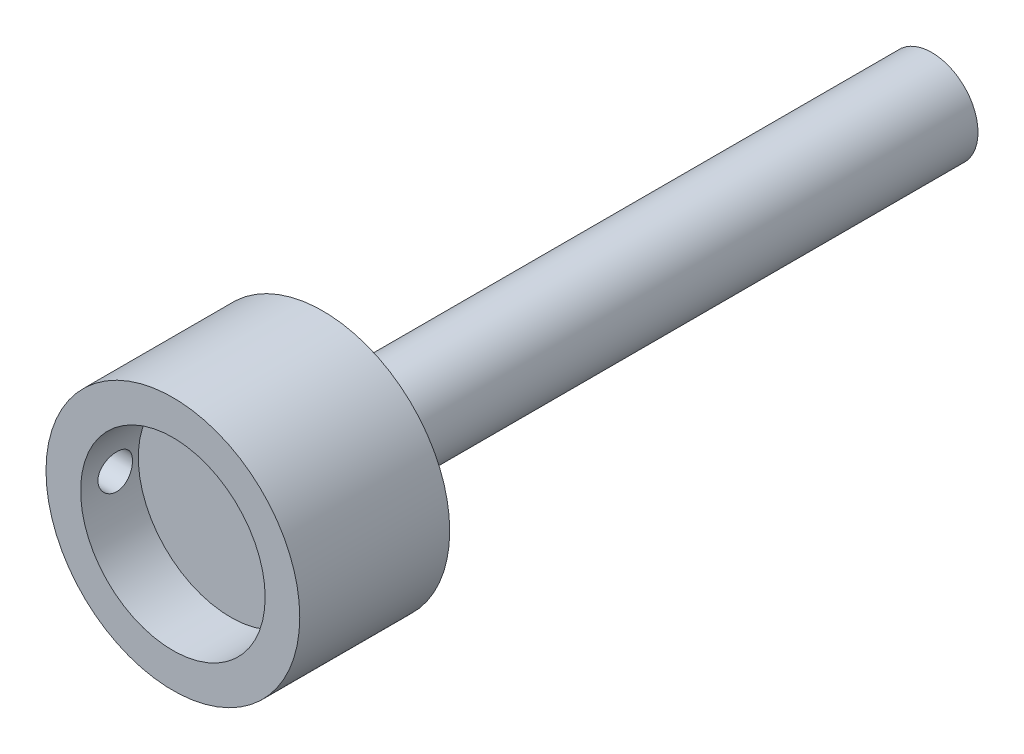
ISO-10303-21;
HEADER;
FILE_DESCRIPTION(('STEP AP214'),'2;1');
FILE_NAME('part.step','',(''),(''),'','','');
FILE_SCHEMA(('AUTOMOTIVE_DESIGN { 1 0 10303 214 1 1 1 1 }'));
ENDSEC;
DATA;
#1=APPLICATION_CONTEXT('core data for automotive mechanical design processes');
#2=APPLICATION_PROTOCOL_DEFINITION('international standard','automotive_design',2000,#1);
#3=PRODUCT_CONTEXT('',#1,'mechanical');
#4=PRODUCT('Part','Part','',(#3));
#5=PRODUCT_RELATED_PRODUCT_CATEGORY('part','',(#4));
#6=PRODUCT_DEFINITION_FORMATION('','',#4);
#7=PRODUCT_DEFINITION_CONTEXT('part definition',#1,'design');
#8=PRODUCT_DEFINITION('design','',#6,#7);
#9=PRODUCT_DEFINITION_SHAPE('','',#8);
#10=(LENGTH_UNIT() NAMED_UNIT(*) SI_UNIT(.MILLI.,.METRE.));
#11=(NAMED_UNIT(*) PLANE_ANGLE_UNIT() SI_UNIT($,.RADIAN.));
#12=(NAMED_UNIT(*) SI_UNIT($,.STERADIAN.) SOLID_ANGLE_UNIT());
#13=UNCERTAINTY_MEASURE_WITH_UNIT(LENGTH_MEASURE(1.E-05),#10,'distance_accuracy_value','');
#14=(GEOMETRIC_REPRESENTATION_CONTEXT(3) GLOBAL_UNCERTAINTY_ASSIGNED_CONTEXT((#13)) GLOBAL_UNIT_ASSIGNED_CONTEXT((#10,
#11,#12)) REPRESENTATION_CONTEXT('',''));
#15=CARTESIAN_POINT('',(0.,0.,0.));
#16=DIRECTION('',(0.,0.,1.));
#17=DIRECTION('',(1.,0.,0.));
#18=AXIS2_PLACEMENT_3D('',#15,#16,#17);
#19=CARTESIAN_POINT('',(0.,0.,13.));
#20=DIRECTION('',(0.,0.,-1.));
#21=DIRECTION('',(-1.,0.,0.));
#22=AXIS2_PLACEMENT_3D('',#19,#20,#21);
#23=CYLINDRICAL_SURFACE('',#22,11.);
#24=CARTESIAN_POINT('',(-11.,0.,11.5));
#25=CARTESIAN_POINT('',(-10.9999987467262,-0.0838384134298608,11.4999964805426));
#26=CARTESIAN_POINT('',(-10.9990314271488,-0.167727602289746,11.4929474073274));
#27=CARTESIAN_POINT('',(-10.9952656640845,-0.333167097641412,11.4649411167757));
#28=CARTESIAN_POINT('',(-10.992465364401,-0.414714945659857,11.4439698005502));
#29=CARTESIAN_POINT('',(-10.9853487739829,-0.573053093693594,11.3887522661594));
#30=CARTESIAN_POINT('',(-10.9810335583919,-0.649846722453227,11.3545154607979));
#31=CARTESIAN_POINT('',(-10.971365727223,-0.79658530244973,11.2737604754398));
#32=CARTESIAN_POINT('',(-10.9660132749006,-0.86653132885872,11.2272442277457));
#33=CARTESIAN_POINT('',(-10.9548285996925,-0.998057563812247,11.1229277857077));
#34=CARTESIAN_POINT('',(-10.9489937690522,-1.05958678462377,11.0650635769965));
#35=CARTESIAN_POINT('',(-10.9375227155932,-1.17209333908044,10.9398313892076));
#36=CARTESIAN_POINT('',(-10.9318865034525,-1.22307010612799,10.8724629001387));
#37=CARTESIAN_POINT('',(-10.9214253777188,-1.31321850524923,10.7297980617759));
#38=CARTESIAN_POINT('',(-10.916603830108,-1.35234166468404,10.6544708149948));
#39=CARTESIAN_POINT('',(-10.9083529406776,-1.41736264485278,10.4982381846263));
#40=CARTESIAN_POINT('',(-10.904923536173,-1.44326106107985,10.4173330523902));
#41=CARTESIAN_POINT('',(-10.8998704969217,-1.4809409055509,10.2527737564264));
#42=CARTESIAN_POINT('',(-10.8982357822449,-1.49280898864549,10.1691397807089));
#43=CARTESIAN_POINT('',(-10.8969234380482,-1.50235955059667,10.0010525269759));
#44=CARTESIAN_POINT('',(-10.8972457153308,-1.50004270497976,9.91659928816724));
#45=CARTESIAN_POINT('',(-10.8998008033656,-1.4813601701924,9.7498782743991));
#46=CARTESIAN_POINT('',(-10.9020205710196,-1.4650903891759,9.66759952363283));
#47=CARTESIAN_POINT('',(-10.9081001740818,-1.419113676953,9.50695095946735));
#48=CARTESIAN_POINT('',(-10.911960048455,-1.38940642650253,9.42858123898703));
#49=CARTESIAN_POINT('',(-10.920899582937,-1.31729641760208,9.27768007396237));
#50=CARTESIAN_POINT('',(-10.9259831927575,-1.27485243857761,9.20516857073198));
#51=CARTESIAN_POINT('',(-10.9367944433469,-1.1785032304482,9.06826085111422));
#52=CARTESIAN_POINT('',(-10.9425221191218,-1.12459737823042,9.00386507623326));
#53=CARTESIAN_POINT('',(-10.954033973898,-1.006325277838,8.88446044550542));
#54=CARTESIAN_POINT('',(-10.9598182294108,-0.941876450734229,8.82953335968757));
#55=CARTESIAN_POINT('',(-10.9707474705779,-0.80463094440541,8.73126350840162));
#56=CARTESIAN_POINT('',(-10.9758924542398,-0.73183423916464,8.68792077903695));
#57=CARTESIAN_POINT('',(-10.9849675408771,-0.57989296948045,8.61404813681996));
#58=CARTESIAN_POINT('',(-10.9888971094847,-0.500745632131289,8.58352385760728));
#59=CARTESIAN_POINT('',(-10.9950939520307,-0.338383087939894,8.5362221620544));
#60=CARTESIAN_POINT('',(-10.997361318692,-0.25516810828013,8.51944397890651));
#61=CARTESIAN_POINT('',(-10.9999661380375,-0.0877389073676727,8.50021791543442));
#62=CARTESIAN_POINT('',(-11.0003187469014,-0.0035378363878437,8.49765749141139));
#63=CARTESIAN_POINT('',(-10.9990953877098,0.164092294089254,8.50664187833073));
#64=CARTESIAN_POINT('',(-10.9975194687383,0.247521373180418,8.51818633028291));
#65=CARTESIAN_POINT('',(-10.9926255265792,0.410903378364946,8.55495922320966));
#66=CARTESIAN_POINT('',(-10.9893144012332,0.490868720620559,8.58013349557132));
#67=CARTESIAN_POINT('',(-10.9813204406364,0.645443141095587,8.64339475903291));
#68=CARTESIAN_POINT('',(-10.9766375509031,0.720052006425216,8.68148226301717));
#69=CARTESIAN_POINT('',(-10.9663836303603,0.86229489298246,8.76975753872403));
#70=CARTESIAN_POINT('',(-10.960807370571,0.929883728353245,8.82001750280037));
#71=CARTESIAN_POINT('',(-10.9494055314268,1.05570701325461,8.93110957795735));
#72=CARTESIAN_POINT('',(-10.9435799402192,1.11394101745332,8.99194219205667));
#73=CARTESIAN_POINT('',(-10.9322886877303,1.21980532954113,9.12295083300841));
#74=CARTESIAN_POINT('',(-10.9268257501214,1.26736066380642,9.19318771348107));
#75=CARTESIAN_POINT('',(-10.9169246504416,1.34999839549265,9.34071830769977));
#76=CARTESIAN_POINT('',(-10.9124864646235,1.38508108196142,9.41801185785858));
#77=CARTESIAN_POINT('',(-10.9051564726067,1.44165849505153,9.57722775667319));
#78=CARTESIAN_POINT('',(-10.902259998972,1.46319427050013,9.65913529443613));
#79=CARTESIAN_POINT('',(-10.8983284316023,1.49219810547519,9.82544652182803));
#80=CARTESIAN_POINT('',(-10.8972932333409,1.49966695497901,9.90985007101435));
#81=CARTESIAN_POINT('',(-10.8972048541528,1.50030856584718,10.078010975391));
#82=CARTESIAN_POINT('',(-10.8981353386205,1.49359914690637,10.1617678966084));
#83=CARTESIAN_POINT('',(-10.9018382005365,1.46632546438534,10.3269511386985));
#84=CARTESIAN_POINT('',(-10.9046105769335,1.44576120871189,10.4083774609012));
#85=CARTESIAN_POINT('',(-10.9116795081979,1.3914005645048,10.5665651393851));
#86=CARTESIAN_POINT('',(-10.9159752803929,1.35761096980691,10.6433288674825));
#87=CARTESIAN_POINT('',(-10.925608111245,1.2777703983912,10.7901162986064));
#88=CARTESIAN_POINT('',(-10.9309451926623,1.23171915365824,10.8601398542606));
#89=CARTESIAN_POINT('',(-10.9421122992185,1.12822915223083,10.9920600365998));
#90=CARTESIAN_POINT('',(-10.9479459056036,1.07070278423403,11.0538876362225));
#91=CARTESIAN_POINT('',(-10.9594178730356,0.946079868053623,11.1670553467108));
#92=CARTESIAN_POINT('',(-10.9650561880416,0.87898108195785,11.2183929983114));
#93=CARTESIAN_POINT('',(-10.9755309296992,0.736765493201999,11.3093259673834));
#94=CARTESIAN_POINT('',(-10.9803636164562,0.661613818517364,11.3488671582763));
#95=CARTESIAN_POINT('',(-10.9886453705716,0.505709693930316,11.414709481053));
#96=CARTESIAN_POINT('',(-10.9920959102772,0.424963312021878,11.4410247096937));
#97=CARTESIAN_POINT('',(-10.9964117606731,0.286518597087191,11.4735104370639));
#98=CARTESIAN_POINT('',(-10.9977506427886,0.229685788696074,11.4834293607973));
#99=CARTESIAN_POINT('',(-10.9995451890738,0.115243313646888,11.4966753209812));
#100=CARTESIAN_POINT('',(-11.0000008615472,0.0576336542977008,11.5000024194064));
#101=CARTESIAN_POINT('',(-11.,0.,11.5));
#102=B_SPLINE_CURVE_WITH_KNOTS('',3,(#24,#25,#26,#27,#28,#29,#30,#31,#32,#33,#34,#35,#36,#37,
#38,#39,#40,#41,#42,#43,#44,#45,#46,#47,#48,#49,#50,#51,#52,#53,#54,#55,#56,#57,#58,#59,#60,#61,
#62,#63,#64,#65,#66,#67,#68,#69,#70,#71,#72,#73,#74,#75,#76,#77,#78,#79,#80,#81,#82,#83,#84,#85,
#86,#87,#88,#89,#90,#91,#92,#93,#94,#95,#96,#97,#98,#99,#100,#101),.UNSPECIFIED.,.T.,.F.,(4,2,2,
2,2,2,2,2,2,2,2,2,2,2,2,2,2,2,2,2,2,2,2,2,2,2,2,2,2,2,2,2,2,2,2,2,2,2,4),(0.,0.251304688086151,
0.502864258429492,0.754245655375319,1.00558751830525,1.25839025869503,1.51120656941612,
1.76504317927172,2.01886835818389,2.27111752000617,2.52335466910191,2.77387178872724,
3.02439486038875,3.27573762185035,3.52709405079555,3.7805228474684,4.0339524339601,
4.28749328511462,4.54101999186671,4.79253696204825,5.04404753088009,5.29456578809544,
5.54509399649483,5.79714607697892,6.04921015271754,6.30299215129409,6.5567682682073,
6.80977166004953,7.06276084317861,7.31365598745061,7.56455098853993,7.81531727406242,
8.06608904128421,8.3188542354437,8.57167862009411,8.82564582024678,9.0793417549426,
9.25209960062624,9.42485582207675),.UNSPECIFIED.);
#103=CARTESIAN_POINT('',(-11.,0.,11.5));
#104=VERTEX_POINT('',#103);
#105=EDGE_CURVE('E58',#104,#104,#102,.T.);
#106=ORIENTED_EDGE('',*,*,#105,.T.);
#107=EDGE_LOOP('',(#106));
#108=FACE_BOUND('',#107,.T.);
#109=CARTESIAN_POINT('',(0.,0.,13.));
#110=DIRECTION('',(0.,0.,1.));
#111=DIRECTION('',(1.,0.,0.));
#112=AXIS2_PLACEMENT_3D('',#109,#110,#111);
#113=CIRCLE('',#112,11.);
#114=CARTESIAN_POINT('',(11.,0.,13.));
#115=VERTEX_POINT('',#114);
#116=EDGE_CURVE('E38',#115,#115,#113,.T.);
#117=ORIENTED_EDGE('',*,*,#116,.F.);
#118=EDGE_LOOP('',(#117));
#119=FACE_BOUND('',#118,.T.);
#120=CARTESIAN_POINT('',(0.,0.,0.));
#121=DIRECTION('',(0.,0.,1.));
#122=DIRECTION('',(1.,0.,0.));
#123=AXIS2_PLACEMENT_3D('',#120,#121,#122);
#124=CIRCLE('',#123,11.);
#125=CARTESIAN_POINT('',(11.,0.,0.));
#126=VERTEX_POINT('',#125);
#127=EDGE_CURVE('E42',#126,#126,#124,.T.);
#128=ORIENTED_EDGE('',*,*,#127,.T.);
#129=EDGE_LOOP('',(#128));
#130=FACE_BOUND('',#129,.T.);
#131=ADVANCED_FACE('F31',(#108,#119,#130),#23,.T.);
#132=CARTESIAN_POINT('',(0.,0.,13.));
#133=DIRECTION('',(0.,0.,1.));
#134=DIRECTION('',(1.,0.,0.));
#135=AXIS2_PLACEMENT_3D('',#132,#133,#134);
#136=PLANE('',#135);
#137=CARTESIAN_POINT('',(0.,0.,13.));
#138=DIRECTION('',(0.,0.,1.));
#139=DIRECTION('',(1.,0.,0.));
#140=AXIS2_PLACEMENT_3D('',#137,#138,#139);
#141=CIRCLE('',#140,8.);
#142=CARTESIAN_POINT('',(8.,0.,13.));
#143=VERTEX_POINT('',#142);
#144=EDGE_CURVE('E50',#143,#143,#141,.T.);
#145=ORIENTED_EDGE('',*,*,#144,.F.);
#146=EDGE_LOOP('',(#145));
#147=FACE_BOUND('',#146,.T.);
#148=ORIENTED_EDGE('',*,*,#116,.T.);
#149=EDGE_LOOP('',(#148));
#150=FACE_BOUND('',#149,.T.);
#151=ADVANCED_FACE('F85',(#147,#150),#136,.T.);
#152=CARTESIAN_POINT('',(0.,0.,0.));
#153=DIRECTION('',(0.,0.,1.));
#154=DIRECTION('',(1.,0.,0.));
#155=AXIS2_PLACEMENT_3D('',#152,#153,#154);
#156=PLANE('',#155);
#157=CARTESIAN_POINT('',(0.,0.,0.));
#158=DIRECTION('',(0.,0.,1.));
#159=DIRECTION('',(1.,0.,0.));
#160=AXIS2_PLACEMENT_3D('',#157,#158,#159);
#161=CIRCLE('',#160,4.);
#162=CARTESIAN_POINT('',(4.,0.,0.));
#163=VERTEX_POINT('',#162);
#164=EDGE_CURVE('E10',#163,#163,#161,.F.);
#165=ORIENTED_EDGE('',*,*,#164,.F.);
#166=EDGE_LOOP('',(#165));
#167=FACE_BOUND('',#166,.T.);
#168=ORIENTED_EDGE('',*,*,#127,.F.);
#169=EDGE_LOOP('',(#168));
#170=FACE_BOUND('',#169,.T.);
#171=ADVANCED_FACE('F87',(#167,#170),#156,.F.);
#172=CARTESIAN_POINT('',(0.,0.,8.));
#173=DIRECTION('',(0.,0.,1.));
#174=DIRECTION('',(1.,0.,0.));
#175=AXIS2_PLACEMENT_3D('',#172,#173,#174);
#176=CYLINDRICAL_SURFACE('',#175,8.);
#177=CARTESIAN_POINT('',(-8.,0.,8.5));
#178=CARTESIAN_POINT('',(-7.99999848833852,-0.0834717464654709,8.50000318958828));
#179=CARTESIAN_POINT('',(-7.99868009921714,-0.166984992730099,8.50699107661938));
#180=CARTESIAN_POINT('',(-7.9935478589052,-0.331658129841798,8.53473999511835));
#181=CARTESIAN_POINT('',(-7.98973190166897,-0.412815974152226,8.55551265063973));
#182=CARTESIAN_POINT('',(-7.98003138765458,-0.570372961851802,8.61017270125934));
#183=CARTESIAN_POINT('',(-7.97414869946483,-0.646776330685345,8.64404825245254));
#184=CARTESIAN_POINT('',(-7.96095710599783,-0.792807973094008,8.72391887692281));
#185=CARTESIAN_POINT('',(-7.9536483161829,-0.862436794477324,8.76991296914482));
#186=CARTESIAN_POINT('',(-7.93831336430504,-0.993783715930504,8.87329976800367));
#187=CARTESIAN_POINT('',(-7.93028034856351,-1.05540895503183,8.93080944467014));
#188=CARTESIAN_POINT('',(-7.9144531845865,-1.16819606135369,9.05534330908756));
#189=CARTESIAN_POINT('',(-7.90665905354527,-1.21935717689242,9.12236817976929));
#190=CARTESIAN_POINT('',(-7.89212551245005,-1.31014998665793,9.26468608836397));
#191=CARTESIAN_POINT('',(-7.88539493886182,-1.34968721969605,9.34004037031724));
#192=CARTESIAN_POINT('',(-7.87384713211987,-1.41550524332283,9.49646891517679));
#193=CARTESIAN_POINT('',(-7.86902973396962,-1.44178717713098,9.57754268411122));
#194=CARTESIAN_POINT('',(-7.8619226957455,-1.480050535035,9.74211523091441));
#195=CARTESIAN_POINT('',(-7.85960445366405,-1.49219390192039,9.82557509720347));
#196=CARTESIAN_POINT('',(-7.85767197152761,-1.50233808095347,9.99337738480825));
#197=CARTESIAN_POINT('',(-7.8580574889876,-1.50034016135374,10.0777197263023));
#198=CARTESIAN_POINT('',(-7.86146292701753,-1.48238979602363,10.243719525266));
#199=CARTESIAN_POINT('',(-7.86444808147334,-1.46662149996045,10.3253977143002));
#200=CARTESIAN_POINT('',(-7.87266183284666,-1.42186799396207,10.4849284197826));
#201=CARTESIAN_POINT('',(-7.87789052509516,-1.392882222395,10.5627807735093));
#202=CARTESIAN_POINT('',(-7.89003855292588,-1.322336471793,10.7129886790003));
#203=CARTESIAN_POINT('',(-7.89696783823366,-1.28070213532456,10.7853084705808));
#204=CARTESIAN_POINT('',(-7.91172971602918,-1.18609368930416,10.9220047285402));
#205=CARTESIAN_POINT('',(-7.91956240015522,-1.13311842889266,10.9863803877148));
#206=CARTESIAN_POINT('',(-7.93540001272164,-1.01633905685298,11.1064249556725));
#207=CARTESIAN_POINT('',(-7.94340571024031,-0.952377436860684,11.1619406524517));
#208=CARTESIAN_POINT('',(-7.95857386108318,-0.815968037098827,11.2614772406754));
#209=CARTESIAN_POINT('',(-7.96573630595245,-0.74352017225577,11.3054980168704));
#210=CARTESIAN_POINT('',(-7.97842539677509,-0.592034988874669,11.38081775387));
#211=CARTESIAN_POINT('',(-7.98394999136289,-0.512989564446494,11.4121007791179));
#212=CARTESIAN_POINT('',(-7.99272505402719,-0.350639115398697,11.4609020930922));
#213=CARTESIAN_POINT('',(-7.99597576367994,-0.267334544277788,11.4784218440454));
#214=CARTESIAN_POINT('',(-7.99980360641981,-0.100148652903386,11.4989860310183));
#215=CARTESIAN_POINT('',(-8.00041950912279,-0.0162940126341361,11.5022403915297));
#216=CARTESIAN_POINT('',(-7.99901543598228,0.150761248092183,11.4947445204524));
#217=CARTESIAN_POINT('',(-7.99699558964431,0.233961900480385,11.4839949769347));
#218=CARTESIAN_POINT('',(-7.99057111500406,0.396681573218216,11.4489709648166));
#219=CARTESIAN_POINT('',(-7.98618522374031,0.476224261046063,11.4248027174622));
#220=CARTESIAN_POINT('',(-7.97551842212498,0.630128631824633,11.3637422932212));
#221=CARTESIAN_POINT('',(-7.96923738311334,0.704489962595103,11.3268492524342));
#222=CARTESIAN_POINT('',(-7.95538030357666,0.846816671513214,11.2409218718405));
#223=CARTESIAN_POINT('',(-7.94779086174563,0.914703277015121,11.1917592614632));
#224=CARTESIAN_POINT('',(-7.93219343489711,1.04133832326455,11.0828618626376));
#225=CARTESIAN_POINT('',(-7.92418541084687,1.10008590976087,11.0231260869987));
#226=CARTESIAN_POINT('',(-7.9085247569745,1.20757295872048,10.8938276810886));
#227=CARTESIAN_POINT('',(-7.90087825860257,1.25616916218577,10.8241450918746));
#228=CARTESIAN_POINT('',(-7.88692985578532,1.34096675057787,10.6774823754763));
#229=CARTESIAN_POINT('',(-7.8806279013735,1.37716859613924,10.6005025196295));
#230=CARTESIAN_POINT('',(-7.87013024209574,1.43594673512823,10.4417941327575));
#231=CARTESIAN_POINT('',(-7.86592440436878,1.45858868794786,10.3600906204407));
#232=CARTESIAN_POINT('',(-7.86007203802415,1.48980679326236,10.1939527774786));
#233=CARTESIAN_POINT('',(-7.8584252206579,1.49838453270708,10.1095187560296));
#234=CARTESIAN_POINT('',(-7.85789199803857,1.50117762148355,9.94175166855849));
#235=CARTESIAN_POINT('',(-7.85896215974293,1.49561895003499,9.85842241904301));
#236=CARTESIAN_POINT('',(-7.86364600659998,1.47079175378803,9.69390857795471));
#237=CARTESIAN_POINT('',(-7.86725967655747,1.45152331089332,9.61272397357256));
#238=CARTESIAN_POINT('',(-7.8766050802318,1.39991887583263,9.45492551520452));
#239=CARTESIAN_POINT('',(-7.88233284594965,1.36760735397253,9.37830340865423));
#240=CARTESIAN_POINT('',(-7.8952638755184,1.29085868912205,9.23153174575916));
#241=CARTESIAN_POINT('',(-7.90246724360119,1.24642068948186,9.16138264715522));
#242=CARTESIAN_POINT('',(-7.91767266107745,1.14589487339535,9.0284163199577));
#243=CARTESIAN_POINT('',(-7.92568505353043,1.08964259864304,8.9657245874329));
#244=CARTESIAN_POINT('',(-7.94152833918735,0.967427926742293,8.85059483753548));
#245=CARTESIAN_POINT('',(-7.94935919027328,0.901463301891617,8.79815917901986));
#246=CARTESIAN_POINT('',(-7.96403975968049,0.760984945071874,8.70458904737294));
#247=CARTESIAN_POINT('',(-7.97088000990561,0.686399590640517,8.66356057150936));
#248=CARTESIAN_POINT('',(-7.98271619380687,0.531290113653834,8.59468236339486));
#249=CARTESIAN_POINT('',(-7.98771385879037,0.450771651705248,8.56682025295309));
#250=CARTESIAN_POINT('',(-7.99428290707632,0.308347202825154,8.53072268558132));
#251=CARTESIAN_POINT('',(-7.99641470878206,0.247273810251871,8.5192213696872));
#252=CARTESIAN_POINT('',(-7.9992737995401,0.124141247115158,8.50385893788355));
#253=CARTESIAN_POINT('',(-8.00000112429805,0.0620821016527094,8.49999762774409));
#254=CARTESIAN_POINT('',(-8.,0.,8.5));
#255=B_SPLINE_CURVE_WITH_KNOTS('',3,(#177,#178,#179,#180,#181,#182,#183,#184,#185,#186,#187,
#188,#189,#190,#191,#192,#193,#194,#195,#196,#197,#198,#199,#200,#201,#202,#203,#204,#205,#206,
#207,#208,#209,#210,#211,#212,#213,#214,#215,#216,#217,#218,#219,#220,#221,#222,#223,#224,#225,
#226,#227,#228,#229,#230,#231,#232,#233,#234,#235,#236,#237,#238,#239,#240,#241,#242,#243,#244,
#245,#246,#247,#248,#249,#250,#251,#252,#253,#254),.UNSPECIFIED.,.T.,.F.,(4,2,2,2,2,2,2,2,2,2,2,
2,2,2,2,2,2,2,2,2,2,2,2,2,2,2,2,2,2,2,2,2,2,2,2,2,2,2,4),(0.,0.250188200964924,
0.500587642535453,0.750761271230908,1.00091465336891,1.25375118013631,1.50660586283617,
1.76146190504358,2.01629596311949,2.26818151445336,2.52004447587256,2.76859000612766,
3.01714609846787,3.26719262629531,3.5172645404986,3.77127768464077,4.02529337544948,
4.27962588321699,4.53393136673746,4.78448174076097,5.03501980464584,5.28360233907829,
5.53220175338032,5.78351778017709,6.03485728413099,6.28953436987299,6.54420198954946,
6.7976262781856,7.05102196946513,7.30039252231749,7.54976158541507,7.79866496207693,
8.04758592655424,8.30023369966381,8.55293951262257,8.80792048916316,9.06266126931174,
9.24874344524411,9.43482089039542),.UNSPECIFIED.);
#256=CARTESIAN_POINT('',(-8.,0.,8.5));
#257=VERTEX_POINT('',#256);
#258=EDGE_CURVE('E52',#257,#257,#255,.T.);
#259=ORIENTED_EDGE('',*,*,#258,.T.);
#260=EDGE_LOOP('',(#259));
#261=FACE_BOUND('',#260,.T.);
#262=CARTESIAN_POINT('',(0.,0.,8.));
#263=DIRECTION('',(0.,0.,1.));
#264=DIRECTION('',(1.,0.,0.));
#265=AXIS2_PLACEMENT_3D('',#262,#263,#264);
#266=CIRCLE('',#265,8.);
#267=CARTESIAN_POINT('',(8.,0.,8.));
#268=VERTEX_POINT('',#267);
#269=EDGE_CURVE('E47',#268,#268,#266,.T.);
#270=ORIENTED_EDGE('',*,*,#269,.F.);
#271=EDGE_LOOP('',(#270));
#272=FACE_BOUND('',#271,.T.);
#273=ORIENTED_EDGE('',*,*,#144,.T.);
#274=EDGE_LOOP('',(#273));
#275=FACE_BOUND('',#274,.T.);
#276=ADVANCED_FACE('F60',(#261,#272,#275),#176,.F.);
#277=CARTESIAN_POINT('',(0.,0.,8.));
#278=DIRECTION('',(0.,0.,1.));
#279=DIRECTION('',(1.,0.,0.));
#280=AXIS2_PLACEMENT_3D('',#277,#278,#279);
#281=PLANE('',#280);
#282=ORIENTED_EDGE('',*,*,#269,.T.);
#283=EDGE_LOOP('',(#282));
#284=FACE_BOUND('',#283,.T.);
#285=ADVANCED_FACE('F69',(#284),#281,.T.);
#286=CARTESIAN_POINT('',(-15.,0.,10.));
#287=DIRECTION('',(1.,0.,0.));
#288=DIRECTION('',(0.,0.,-1.));
#289=AXIS2_PLACEMENT_3D('',#286,#287,#288);
#290=CYLINDRICAL_SURFACE('',#289,1.5);
#291=ORIENTED_EDGE('',*,*,#258,.F.);
#292=EDGE_LOOP('',(#291));
#293=FACE_BOUND('',#292,.T.);
#294=ORIENTED_EDGE('',*,*,#105,.F.);
#295=EDGE_LOOP('',(#294));
#296=FACE_BOUND('',#295,.T.);
#297=ADVANCED_FACE('F64',(#293,#296),#290,.F.);
#298=CARTESIAN_POINT('',(0.,0.,-52.8));
#299=DIRECTION('',(0.,0.,1.));
#300=DIRECTION('',(1.,0.,0.));
#301=AXIS2_PLACEMENT_3D('',#298,#299,#300);
#302=CYLINDRICAL_SURFACE('',#301,4.);
#303=CARTESIAN_POINT('',(0.,0.,-52.8));
#304=DIRECTION('',(0.,0.,-1.));
#305=DIRECTION('',(-1.,0.,0.));
#306=AXIS2_PLACEMENT_3D('',#303,#304,#305);
#307=CIRCLE('',#306,4.);
#308=CARTESIAN_POINT('',(-4.,0.,-52.8));
#309=VERTEX_POINT('',#308);
#310=EDGE_CURVE('E59',#309,#309,#307,.T.);
#311=ORIENTED_EDGE('',*,*,#310,.F.);
#312=EDGE_LOOP('',(#311));
#313=FACE_BOUND('',#312,.T.);
#314=ORIENTED_EDGE('',*,*,#164,.T.);
#315=EDGE_LOOP('',(#314));
#316=FACE_BOUND('',#315,.T.);
#317=ADVANCED_FACE('F68',(#313,#316),#302,.T.);
#318=CARTESIAN_POINT('',(0.,0.,-52.8));
#319=DIRECTION('',(0.,0.,-1.));
#320=DIRECTION('',(-1.,0.,0.));
#321=AXIS2_PLACEMENT_3D('',#318,#319,#320);
#322=PLANE('',#321);
#323=ORIENTED_EDGE('',*,*,#310,.T.);
#324=EDGE_LOOP('',(#323));
#325=FACE_BOUND('',#324,.T.);
#326=ADVANCED_FACE('F136',(#325),#322,.T.);
#327=CLOSED_SHELL('',(#131,#151,#171,#276,#285,#297,#317,#326));
#328=MANIFOLD_SOLID_BREP('B2',#327);
#329=ADVANCED_BREP_SHAPE_REPRESENTATION('',(#18,#328),#14);
#330=SHAPE_DEFINITION_REPRESENTATION(#9,#329);
ENDSEC;
END-ISO-10303-21;
